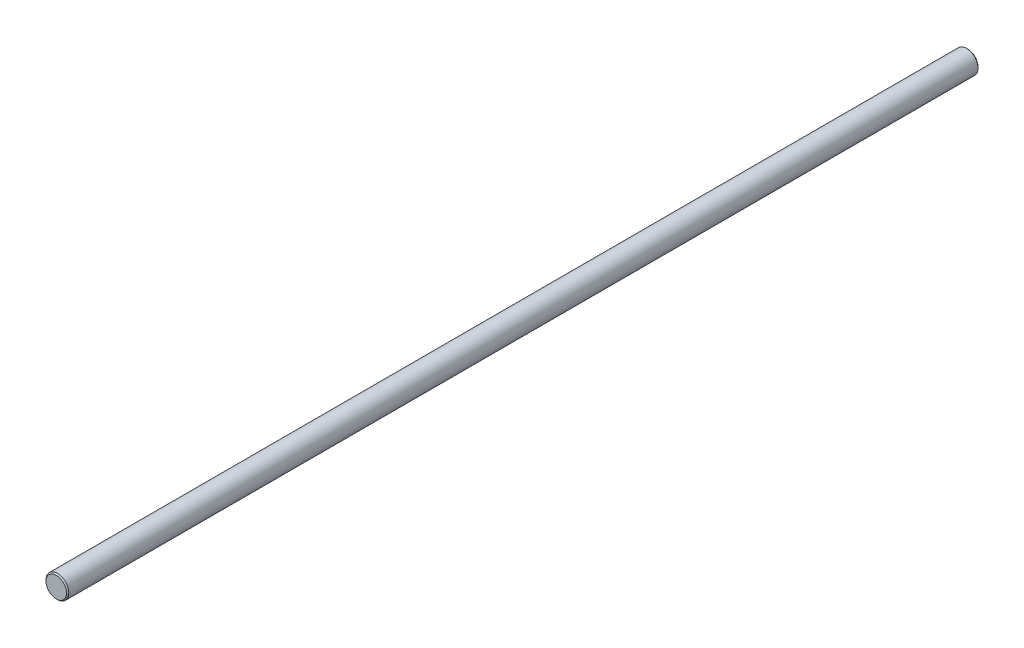
ISO-10303-21;
HEADER;
FILE_DESCRIPTION(('STEP AP214'),'2;1');
FILE_NAME('part.step','',(''),(''),'','','');
FILE_SCHEMA(('AUTOMOTIVE_DESIGN { 1 0 10303 214 1 1 1 1 }'));
ENDSEC;
DATA;
#1=APPLICATION_CONTEXT('core data for automotive mechanical design processes');
#2=APPLICATION_PROTOCOL_DEFINITION('international standard','automotive_design',2000,#1);
#3=PRODUCT_CONTEXT('',#1,'mechanical');
#4=PRODUCT('Part','Part','',(#3));
#5=PRODUCT_RELATED_PRODUCT_CATEGORY('part','',(#4));
#6=PRODUCT_DEFINITION_FORMATION('','',#4);
#7=PRODUCT_DEFINITION_CONTEXT('part definition',#1,'design');
#8=PRODUCT_DEFINITION('design','',#6,#7);
#9=PRODUCT_DEFINITION_SHAPE('','',#8);
#10=(LENGTH_UNIT() NAMED_UNIT(*) SI_UNIT(.MILLI.,.METRE.));
#11=(NAMED_UNIT(*) PLANE_ANGLE_UNIT() SI_UNIT($,.RADIAN.));
#12=(NAMED_UNIT(*) SI_UNIT($,.STERADIAN.) SOLID_ANGLE_UNIT());
#13=UNCERTAINTY_MEASURE_WITH_UNIT(LENGTH_MEASURE(1.E-05),#10,'distance_accuracy_value','');
#14=(GEOMETRIC_REPRESENTATION_CONTEXT(3) GLOBAL_UNCERTAINTY_ASSIGNED_CONTEXT((#13)) GLOBAL_UNIT_ASSIGNED_CONTEXT((#10,
#11,#12)) REPRESENTATION_CONTEXT('',''));
#15=CARTESIAN_POINT('',(0.,0.,0.));
#16=DIRECTION('',(0.,0.,1.));
#17=DIRECTION('',(1.,0.,0.));
#18=AXIS2_PLACEMENT_3D('',#15,#16,#17);
#19=CARTESIAN_POINT('',(0.,0.,400.));
#20=DIRECTION('',(0.,0.,-1.));
#21=DIRECTION('',(-1.,0.,0.));
#22=AXIS2_PLACEMENT_3D('',#19,#20,#21);
#23=CYLINDRICAL_SURFACE('',#22,5.);
#24=CARTESIAN_POINT('',(0.,0.,399.5));
#25=DIRECTION('',(0.,0.,1.));
#26=DIRECTION('',(1.,0.,0.));
#27=AXIS2_PLACEMENT_3D('',#24,#25,#26);
#28=CIRCLE('',#27,5.);
#29=CARTESIAN_POINT('',(5.,0.,399.5));
#30=VERTEX_POINT('',#29);
#31=EDGE_CURVE('E37',#30,#30,#28,.F.);
#32=ORIENTED_EDGE('',*,*,#31,.T.);
#33=EDGE_LOOP('',(#32));
#34=FACE_BOUND('',#33,.T.);
#35=CARTESIAN_POINT('',(0.,0.,0.500000000000167));
#36=DIRECTION('',(0.,0.,1.));
#37=DIRECTION('',(1.,0.,0.));
#38=AXIS2_PLACEMENT_3D('',#35,#36,#37);
#39=CIRCLE('',#38,5.);
#40=CARTESIAN_POINT('',(5.,0.,0.500000000000167));
#41=VERTEX_POINT('',#40);
#42=EDGE_CURVE('E41',#41,#41,#39,.T.);
#43=ORIENTED_EDGE('',*,*,#42,.T.);
#44=EDGE_LOOP('',(#43));
#45=FACE_BOUND('',#44,.T.);
#46=ADVANCED_FACE('F30',(#34,#45),#23,.T.);
#47=CARTESIAN_POINT('',(0.,0.,400.));
#48=DIRECTION('',(0.,0.,1.));
#49=DIRECTION('',(1.,0.,0.));
#50=AXIS2_PLACEMENT_3D('',#47,#48,#49);
#51=PLANE('',#50);
#52=CARTESIAN_POINT('',(0.,0.,400.));
#53=DIRECTION('',(0.,0.,1.));
#54=DIRECTION('',(1.,0.,0.));
#55=AXIS2_PLACEMENT_3D('',#52,#53,#54);
#56=CIRCLE('',#55,4.49999999999995);
#57=CARTESIAN_POINT('',(4.49999999999995,0.,400.));
#58=VERTEX_POINT('',#57);
#59=EDGE_CURVE('E45',#58,#58,#56,.T.);
#60=ORIENTED_EDGE('',*,*,#59,.T.);
#61=EDGE_LOOP('',(#60));
#62=FACE_BOUND('',#61,.T.);
#63=ADVANCED_FACE('F51',(#62),#51,.T.);
#64=CARTESIAN_POINT('',(0.,0.,0.));
#65=DIRECTION('',(0.,0.,1.));
#66=DIRECTION('',(1.,0.,0.));
#67=AXIS2_PLACEMENT_3D('',#64,#65,#66);
#68=PLANE('',#67);
#69=CARTESIAN_POINT('',(0.,0.,0.));
#70=DIRECTION('',(0.,0.,1.));
#71=DIRECTION('',(1.,0.,0.));
#72=AXIS2_PLACEMENT_3D('',#69,#70,#71);
#73=CIRCLE('',#72,4.49999999999984);
#74=CARTESIAN_POINT('',(4.49999999999984,0.,0.));
#75=VERTEX_POINT('',#74);
#76=EDGE_CURVE('E10',#75,#75,#73,.F.);
#77=ORIENTED_EDGE('',*,*,#76,.T.);
#78=EDGE_LOOP('',(#77));
#79=FACE_BOUND('',#78,.T.);
#80=ADVANCED_FACE('F55',(#79),#68,.F.);
#81=CARTESIAN_POINT('',(0.,0.,400.));
#82=DIRECTION('',(0.,0.,-1.));
#83=DIRECTION('',(-1.,0.,0.));
#84=AXIS2_PLACEMENT_3D('',#81,#82,#83);
#85=CONICAL_SURFACE('',#84,4.49999999999995,0.785398163397499);
#86=ORIENTED_EDGE('',*,*,#31,.F.);
#87=EDGE_LOOP('',(#86));
#88=FACE_BOUND('',#87,.T.);
#89=ORIENTED_EDGE('',*,*,#59,.F.);
#90=EDGE_LOOP('',(#89));
#91=FACE_BOUND('',#90,.T.);
#92=ADVANCED_FACE('F53',(#88,#91),#85,.T.);
#93=CARTESIAN_POINT('',(0.,0.,0.500000000000167));
#94=DIRECTION('',(0.,0.,1.));
#95=DIRECTION('',(1.,0.,0.));
#96=AXIS2_PLACEMENT_3D('',#93,#94,#95);
#97=CONICAL_SURFACE('',#96,5.,0.785398163397444);
#98=ORIENTED_EDGE('',*,*,#76,.F.);
#99=EDGE_LOOP('',(#98));
#100=FACE_BOUND('',#99,.T.);
#101=ORIENTED_EDGE('',*,*,#42,.F.);
#102=EDGE_LOOP('',(#101));
#103=FACE_BOUND('',#102,.T.);
#104=ADVANCED_FACE('F32',(#100,#103),#97,.T.);
#105=CLOSED_SHELL('',(#46,#63,#80,#92,#104));
#106=MANIFOLD_SOLID_BREP('B2',#105);
#107=ADVANCED_BREP_SHAPE_REPRESENTATION('',(#18,#106),#14);
#108=SHAPE_DEFINITION_REPRESENTATION(#9,#107);
ENDSEC;
END-ISO-10303-21;
